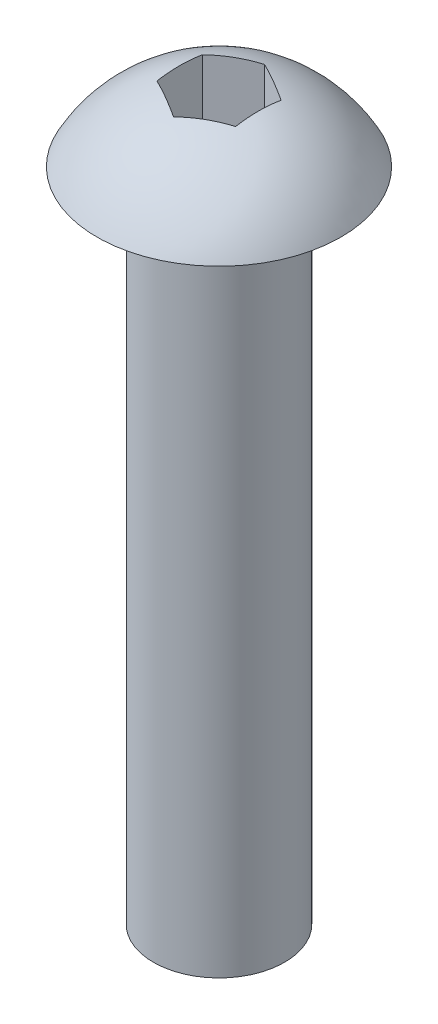
ISO-10303-21;
HEADER;
FILE_DESCRIPTION(('STEP AP214'),'2;1');
FILE_NAME('part.step','',(''),(''),'','','');
FILE_SCHEMA(('AUTOMOTIVE_DESIGN { 1 0 10303 214 1 1 1 1 }'));
ENDSEC;
DATA;
#1=APPLICATION_CONTEXT('core data for automotive mechanical design processes');
#2=APPLICATION_PROTOCOL_DEFINITION('international standard','automotive_design',2000,#1);
#3=PRODUCT_CONTEXT('',#1,'mechanical');
#4=PRODUCT('Part','Part','',(#3));
#5=PRODUCT_RELATED_PRODUCT_CATEGORY('part','',(#4));
#6=PRODUCT_DEFINITION_FORMATION('','',#4);
#7=PRODUCT_DEFINITION_CONTEXT('part definition',#1,'design');
#8=PRODUCT_DEFINITION('design','',#6,#7);
#9=PRODUCT_DEFINITION_SHAPE('','',#8);
#10=(LENGTH_UNIT() NAMED_UNIT(*) SI_UNIT(.MILLI.,.METRE.));
#11=(NAMED_UNIT(*) PLANE_ANGLE_UNIT() SI_UNIT($,.RADIAN.));
#12=(NAMED_UNIT(*) SI_UNIT($,.STERADIAN.) SOLID_ANGLE_UNIT());
#13=UNCERTAINTY_MEASURE_WITH_UNIT(LENGTH_MEASURE(1.E-05),#10,'distance_accuracy_value','');
#14=(GEOMETRIC_REPRESENTATION_CONTEXT(3) GLOBAL_UNCERTAINTY_ASSIGNED_CONTEXT((#13)) GLOBAL_UNIT_ASSIGNED_CONTEXT((#10,
#11,#12)) REPRESENTATION_CONTEXT('',''));
#15=CARTESIAN_POINT('',(0.,0.,0.));
#16=DIRECTION('',(0.,0.,1.));
#17=DIRECTION('',(1.,0.,0.));
#18=AXIS2_PLACEMENT_3D('',#15,#16,#17);
#19=CARTESIAN_POINT('',(0.,-2.46116071428572,0.));
#20=DIRECTION('',(0.,1.,0.));
#21=DIRECTION('',(1.,0.,0.));
#22=AXIS2_PLACEMENT_3D('',#19,#20,#21);
#23=SPHERICAL_SURFACE('',#22,5.26116071428571);
#24=CARTESIAN_POINT('',(0.,0.,0.));
#25=DIRECTION('',(0.,1.,0.));
#26=DIRECTION('',(-1.,0.,0.));
#27=AXIS2_PLACEMENT_3D('',#24,#25,#26);
#28=CIRCLE('',#27,4.65);
#29=CARTESIAN_POINT('',(-4.65,0.,0.));
#30=VERTEX_POINT('',#29);
#31=EDGE_CURVE('E127',#30,#30,#28,.T.);
#32=ORIENTED_EDGE('',*,*,#31,.T.);
#33=EDGE_LOOP('',(#32));
#34=FACE_BOUND('',#33,.T.);
#35=CARTESIAN_POINT('',(0.75,-2.46116071428572,-1.29903810567666));
#36=DIRECTION('',(-0.5,0.,0.866025403784439));
#37=DIRECTION('',(0.866025403784439,0.,0.5));
#38=AXIS2_PLACEMENT_3D('',#35,#36,#37);
#39=CIRCLE('',#38,5.04279803894062);
#40=CARTESIAN_POINT('',(1.5,2.50671730973454,-0.866025403784439));
#41=VERTEX_POINT('',#40);
#42=CARTESIAN_POINT('',(0.,2.50671730973454,-1.73205080756888));
#43=VERTEX_POINT('',#42);
#44=EDGE_CURVE('E11',#41,#43,#39,.T.);
#45=ORIENTED_EDGE('',*,*,#44,.F.);
#46=CARTESIAN_POINT('',(1.5,-2.46116071428572,0.));
#47=DIRECTION('',(-1.,0.,0.));
#48=DIRECTION('',(0.,0.,1.));
#49=AXIS2_PLACEMENT_3D('',#46,#47,#48);
#50=CIRCLE('',#49,5.04279803894062);
#51=CARTESIAN_POINT('',(1.5,2.50671730973454,0.866025403784439));
#52=VERTEX_POINT('',#51);
#53=EDGE_CURVE('E130',#52,#41,#50,.T.);
#54=ORIENTED_EDGE('',*,*,#53,.F.);
#55=CARTESIAN_POINT('',(0.75,-2.46116071428572,1.29903810567666));
#56=DIRECTION('',(-0.5,0.,-0.866025403784439));
#57=DIRECTION('',(-0.866025403784439,0.,0.5));
#58=AXIS2_PLACEMENT_3D('',#55,#56,#57);
#59=CIRCLE('',#58,5.04279803894062);
#60=CARTESIAN_POINT('',(0.,2.50671730973454,1.73205080756888));
#61=VERTEX_POINT('',#60);
#62=EDGE_CURVE('E132',#61,#52,#59,.T.);
#63=ORIENTED_EDGE('',*,*,#62,.F.);
#64=CARTESIAN_POINT('',(-0.750000000000001,-2.46116071428572,1.29903810567666));
#65=DIRECTION('',(0.5,0.,-0.866025403784439));
#66=DIRECTION('',(-0.866025403784439,0.,-0.5));
#67=AXIS2_PLACEMENT_3D('',#64,#65,#66);
#68=CIRCLE('',#67,5.04279803894062);
#69=CARTESIAN_POINT('',(-1.5,2.50671730973454,0.866025403784439));
#70=VERTEX_POINT('',#69);
#71=EDGE_CURVE('E134',#70,#61,#68,.T.);
#72=ORIENTED_EDGE('',*,*,#71,.F.);
#73=CARTESIAN_POINT('',(-1.5,-2.46116071428572,0.));
#74=DIRECTION('',(1.,0.,0.));
#75=DIRECTION('',(0.,0.,-1.));
#76=AXIS2_PLACEMENT_3D('',#73,#74,#75);
#77=CIRCLE('',#76,5.04279803894062);
#78=CARTESIAN_POINT('',(-1.5,2.50671730973454,-0.866025403784439));
#79=VERTEX_POINT('',#78);
#80=EDGE_CURVE('E136',#79,#70,#77,.T.);
#81=ORIENTED_EDGE('',*,*,#80,.F.);
#82=CARTESIAN_POINT('',(-0.75,-2.46116071428572,-1.29903810567666));
#83=DIRECTION('',(0.5,0.,0.866025403784439));
#84=DIRECTION('',(0.866025403784439,0.,-0.5));
#85=AXIS2_PLACEMENT_3D('',#82,#83,#84);
#86=CIRCLE('',#85,5.04279803894062);
#87=EDGE_CURVE('E40',#43,#79,#86,.T.);
#88=ORIENTED_EDGE('',*,*,#87,.F.);
#89=EDGE_LOOP('',(#45,#54,#63,#72,#81,#88));
#90=FACE_BOUND('',#89,.T.);
#91=ADVANCED_FACE('F33',(#34,#90),#23,.T.);
#92=CARTESIAN_POINT('',(2.5,0.,0.));
#93=DIRECTION('',(0.,1.,0.));
#94=DIRECTION('',(-1.,0.,0.));
#95=AXIS2_PLACEMENT_3D('',#92,#93,#94);
#96=PLANE('',#95);
#97=ORIENTED_EDGE('',*,*,#31,.F.);
#98=EDGE_LOOP('',(#97));
#99=FACE_BOUND('',#98,.T.);
#100=CARTESIAN_POINT('',(0.,0.,0.));
#101=DIRECTION('',(0.,1.,0.));
#102=DIRECTION('',(-1.,0.,0.));
#103=AXIS2_PLACEMENT_3D('',#100,#101,#102);
#104=CIRCLE('',#103,2.5);
#105=CARTESIAN_POINT('',(-2.5,0.,0.));
#106=VERTEX_POINT('',#105);
#107=EDGE_CURVE('E124',#106,#106,#104,.T.);
#108=ORIENTED_EDGE('',*,*,#107,.T.);
#109=EDGE_LOOP('',(#108));
#110=FACE_BOUND('',#109,.T.);
#111=ADVANCED_FACE('F162',(#99,#110),#96,.F.);
#112=CARTESIAN_POINT('',(0.,0.,0.));
#113=DIRECTION('',(0.,1.,0.));
#114=DIRECTION('',(-1.,0.,0.));
#115=AXIS2_PLACEMENT_3D('',#112,#113,#114);
#116=CYLINDRICAL_SURFACE('',#115,2.5);
#117=ORIENTED_EDGE('',*,*,#107,.F.);
#118=EDGE_LOOP('',(#117));
#119=FACE_BOUND('',#118,.T.);
#120=CARTESIAN_POINT('',(0.,-25.,0.));
#121=DIRECTION('',(0.,1.,0.));
#122=DIRECTION('',(-1.,0.,0.));
#123=AXIS2_PLACEMENT_3D('',#120,#121,#122);
#124=CIRCLE('',#123,2.5);
#125=CARTESIAN_POINT('',(-2.49999999999999,-25.,0.));
#126=VERTEX_POINT('',#125);
#127=EDGE_CURVE('E89',#126,#126,#124,.T.);
#128=ORIENTED_EDGE('',*,*,#127,.T.);
#129=EDGE_LOOP('',(#128));
#130=FACE_BOUND('',#129,.T.);
#131=ADVANCED_FACE('F167',(#119,#130),#116,.T.);
#132=CARTESIAN_POINT('',(0.,-25.,0.));
#133=DIRECTION('',(0.,1.,0.));
#134=DIRECTION('',(-1.,0.,0.));
#135=AXIS2_PLACEMENT_3D('',#132,#133,#134);
#136=PLANE('',#135);
#137=ORIENTED_EDGE('',*,*,#127,.F.);
#138=EDGE_LOOP('',(#137));
#139=FACE_BOUND('',#138,.T.);
#140=ADVANCED_FACE('F175',(#139),#136,.F.);
#141=CARTESIAN_POINT('',(1.5,10.,-0.866025403784439));
#142=DIRECTION('',(-0.5,0.,0.866025403784439));
#143=DIRECTION('',(0.866025403784439,0.,0.5));
#144=AXIS2_PLACEMENT_3D('',#141,#142,#143);
#145=PLANE('',#144);
#146=ORIENTED_EDGE('',*,*,#44,.T.);
#147=DIRECTION('',(0.,-1.,0.));
#148=VECTOR('',#147,1.);
#149=CARTESIAN_POINT('',(0.,10.,-1.73205080756888));
#150=LINE('',#149,#148);
#151=CARTESIAN_POINT('',(0.,0.,-1.73205080756888));
#152=VERTEX_POINT('',#151);
#153=EDGE_CURVE('E82',#43,#152,#150,.T.);
#154=ORIENTED_EDGE('',*,*,#153,.T.);
#155=DIRECTION('',(-0.866025403784439,0.,-0.5));
#156=VECTOR('',#155,1.);
#157=CARTESIAN_POINT('',(1.5,0.,-0.866025403784439));
#158=LINE('',#157,#156);
#159=CARTESIAN_POINT('',(1.5,0.,-0.866025403784439));
#160=VERTEX_POINT('',#159);
#161=EDGE_CURVE('E86',#160,#152,#158,.T.);
#162=ORIENTED_EDGE('',*,*,#161,.F.);
#163=DIRECTION('',(0.,-1.,0.));
#164=VECTOR('',#163,1.);
#165=CARTESIAN_POINT('',(1.5,10.,-0.866025403784439));
#166=LINE('',#165,#164);
#167=EDGE_CURVE('E114',#41,#160,#166,.T.);
#168=ORIENTED_EDGE('',*,*,#167,.F.);
#169=EDGE_LOOP('',(#146,#154,#162,#168));
#170=FACE_BOUND('',#169,.T.);
#171=ADVANCED_FACE('F84',(#170),#145,.T.);
#172=CARTESIAN_POINT('',(0.,10.,-1.73205080756888));
#173=DIRECTION('',(0.5,0.,0.866025403784439));
#174=DIRECTION('',(0.866025403784439,0.,-0.5));
#175=AXIS2_PLACEMENT_3D('',#172,#173,#174);
#176=PLANE('',#175);
#177=ORIENTED_EDGE('',*,*,#87,.T.);
#178=DIRECTION('',(0.,-1.,0.));
#179=VECTOR('',#178,1.);
#180=CARTESIAN_POINT('',(-1.5,10.,-0.866025403784439));
#181=LINE('',#180,#179);
#182=CARTESIAN_POINT('',(-1.5,0.,-0.866025403784439));
#183=VERTEX_POINT('',#182);
#184=EDGE_CURVE('E90',#79,#183,#181,.T.);
#185=ORIENTED_EDGE('',*,*,#184,.T.);
#186=DIRECTION('',(-0.866025403784439,0.,0.5));
#187=VECTOR('',#186,1.);
#188=CARTESIAN_POINT('',(0.,0.,-1.73205080756888));
#189=LINE('',#188,#187);
#190=EDGE_CURVE('E93',#152,#183,#189,.T.);
#191=ORIENTED_EDGE('',*,*,#190,.F.);
#192=ORIENTED_EDGE('',*,*,#153,.F.);
#193=EDGE_LOOP('',(#177,#185,#191,#192));
#194=FACE_BOUND('',#193,.T.);
#195=ADVANCED_FACE('F94',(#194),#176,.T.);
#196=CARTESIAN_POINT('',(-1.5,10.,-0.866025403784439));
#197=DIRECTION('',(1.,0.,0.));
#198=DIRECTION('',(0.,0.,-1.));
#199=AXIS2_PLACEMENT_3D('',#196,#197,#198);
#200=PLANE('',#199);
#201=ORIENTED_EDGE('',*,*,#80,.T.);
#202=DIRECTION('',(0.,-1.,0.));
#203=VECTOR('',#202,1.);
#204=CARTESIAN_POINT('',(-1.5,10.,0.866025403784439));
#205=LINE('',#204,#203);
#206=CARTESIAN_POINT('',(-1.5,0.,0.866025403784439));
#207=VERTEX_POINT('',#206);
#208=EDGE_CURVE('E119',#70,#207,#205,.T.);
#209=ORIENTED_EDGE('',*,*,#208,.T.);
#210=DIRECTION('',(0.,0.,1.));
#211=VECTOR('',#210,1.);
#212=CARTESIAN_POINT('',(-1.5,0.,-0.866025403784439));
#213=LINE('',#212,#211);
#214=EDGE_CURVE('E99',#183,#207,#213,.T.);
#215=ORIENTED_EDGE('',*,*,#214,.F.);
#216=ORIENTED_EDGE('',*,*,#184,.F.);
#217=EDGE_LOOP('',(#201,#209,#215,#216));
#218=FACE_BOUND('',#217,.T.);
#219=ADVANCED_FACE('F140',(#218),#200,.T.);
#220=CARTESIAN_POINT('',(-1.5,10.,0.866025403784439));
#221=DIRECTION('',(0.5,0.,-0.866025403784439));
#222=DIRECTION('',(-0.866025403784439,0.,-0.5));
#223=AXIS2_PLACEMENT_3D('',#220,#221,#222);
#224=PLANE('',#223);
#225=ORIENTED_EDGE('',*,*,#71,.T.);
#226=DIRECTION('',(0.,-1.,0.));
#227=VECTOR('',#226,1.);
#228=CARTESIAN_POINT('',(0.,10.,1.73205080756888));
#229=LINE('',#228,#227);
#230=CARTESIAN_POINT('',(0.,0.,1.73205080756888));
#231=VERTEX_POINT('',#230);
#232=EDGE_CURVE('E117',#61,#231,#229,.T.);
#233=ORIENTED_EDGE('',*,*,#232,.T.);
#234=DIRECTION('',(0.866025403784438,0.,0.5));
#235=VECTOR('',#234,1.);
#236=CARTESIAN_POINT('',(-1.5,0.,0.866025403784439));
#237=LINE('',#236,#235);
#238=EDGE_CURVE('E108',#207,#231,#237,.T.);
#239=ORIENTED_EDGE('',*,*,#238,.F.);
#240=ORIENTED_EDGE('',*,*,#208,.F.);
#241=EDGE_LOOP('',(#225,#233,#239,#240));
#242=FACE_BOUND('',#241,.T.);
#243=ADVANCED_FACE('F147',(#242),#224,.T.);
#244=CARTESIAN_POINT('',(0.,10.,1.73205080756888));
#245=DIRECTION('',(-0.5,0.,-0.866025403784439));
#246=DIRECTION('',(-0.866025403784439,0.,0.5));
#247=AXIS2_PLACEMENT_3D('',#244,#245,#246);
#248=PLANE('',#247);
#249=ORIENTED_EDGE('',*,*,#62,.T.);
#250=DIRECTION('',(0.,-1.,0.));
#251=VECTOR('',#250,1.);
#252=CARTESIAN_POINT('',(1.5,10.,0.866025403784439));
#253=LINE('',#252,#251);
#254=CARTESIAN_POINT('',(1.5,0.,0.866025403784439));
#255=VERTEX_POINT('',#254);
#256=EDGE_CURVE('E47',#52,#255,#253,.T.);
#257=ORIENTED_EDGE('',*,*,#256,.T.);
#258=DIRECTION('',(0.866025403784439,0.,-0.5));
#259=VECTOR('',#258,1.);
#260=CARTESIAN_POINT('',(0.,0.,1.73205080756888));
#261=LINE('',#260,#259);
#262=EDGE_CURVE('E111',#231,#255,#261,.T.);
#263=ORIENTED_EDGE('',*,*,#262,.F.);
#264=ORIENTED_EDGE('',*,*,#232,.F.);
#265=EDGE_LOOP('',(#249,#257,#263,#264));
#266=FACE_BOUND('',#265,.T.);
#267=ADVANCED_FACE('F151',(#266),#248,.T.);
#268=CARTESIAN_POINT('',(1.5,10.,0.866025403784439));
#269=DIRECTION('',(-1.,0.,0.));
#270=DIRECTION('',(0.,0.,1.));
#271=AXIS2_PLACEMENT_3D('',#268,#269,#270);
#272=PLANE('',#271);
#273=ORIENTED_EDGE('',*,*,#53,.T.);
#274=ORIENTED_EDGE('',*,*,#167,.T.);
#275=DIRECTION('',(0.,0.,-1.));
#276=VECTOR('',#275,1.);
#277=CARTESIAN_POINT('',(1.5,0.,0.866025403784439));
#278=LINE('',#277,#276);
#279=EDGE_CURVE('E104',#255,#160,#278,.T.);
#280=ORIENTED_EDGE('',*,*,#279,.F.);
#281=ORIENTED_EDGE('',*,*,#256,.F.);
#282=EDGE_LOOP('',(#273,#274,#280,#281));
#283=FACE_BOUND('',#282,.T.);
#284=ADVANCED_FACE('F152',(#283),#272,.T.);
#285=CARTESIAN_POINT('',(0.,0.,0.));
#286=DIRECTION('',(0.,1.,0.));
#287=DIRECTION('',(0.,0.,1.));
#288=AXIS2_PLACEMENT_3D('',#285,#286,#287);
#289=PLANE('',#288);
#290=ORIENTED_EDGE('',*,*,#161,.T.);
#291=ORIENTED_EDGE('',*,*,#190,.T.);
#292=ORIENTED_EDGE('',*,*,#214,.T.);
#293=ORIENTED_EDGE('',*,*,#238,.T.);
#294=ORIENTED_EDGE('',*,*,#262,.T.);
#295=ORIENTED_EDGE('',*,*,#279,.T.);
#296=EDGE_LOOP('',(#290,#291,#292,#293,#294,#295));
#297=FACE_BOUND('',#296,.T.);
#298=ADVANCED_FACE('F102',(#297),#289,.T.);
#299=CLOSED_SHELL('',(#91,#111,#131,#140,#171,#195,#219,#243,#267,#284,#298));
#300=MANIFOLD_SOLID_BREP('B2',#299);
#301=ADVANCED_BREP_SHAPE_REPRESENTATION('',(#18,#300),#14);
#302=SHAPE_DEFINITION_REPRESENTATION(#9,#301);
ENDSEC;
END-ISO-10303-21;
